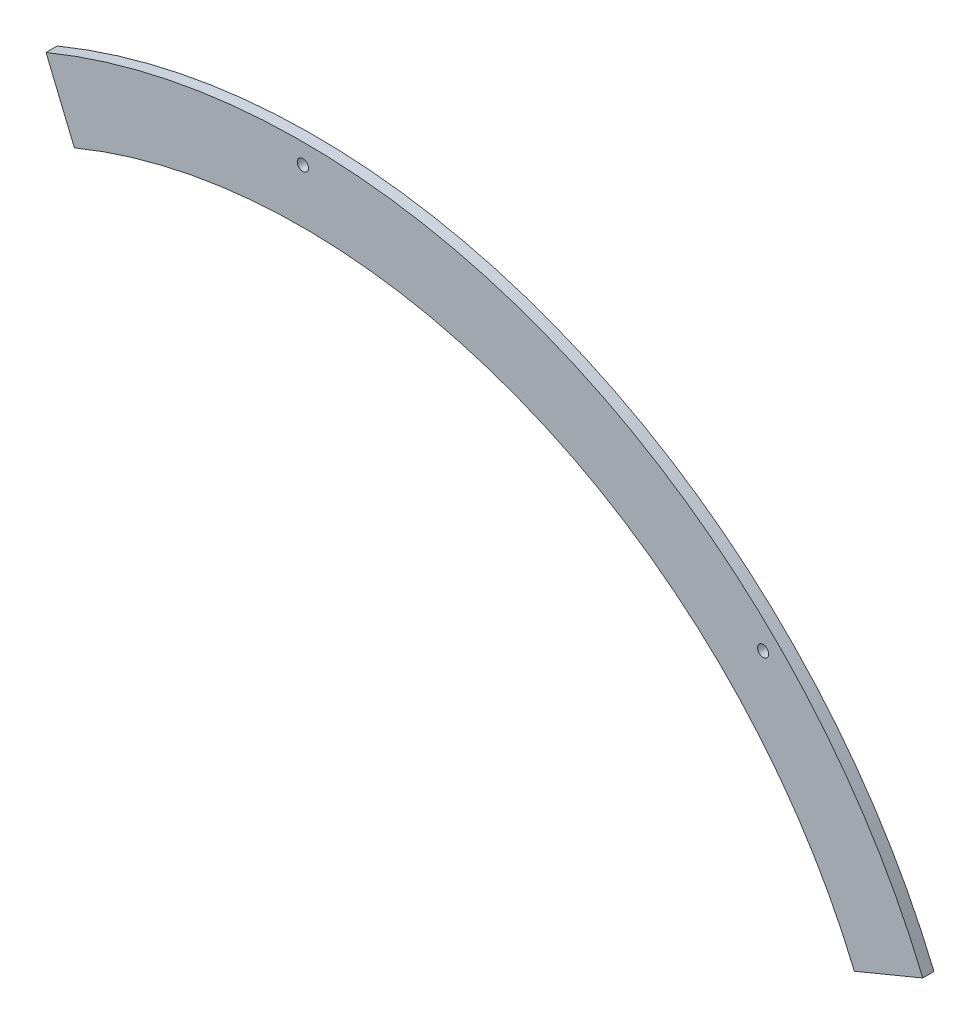
ISO-10303-21;
HEADER;
FILE_DESCRIPTION(('STEP AP214'),'2;1');
FILE_NAME('part.step','',(''),(''),'','','');
FILE_SCHEMA(('AUTOMOTIVE_DESIGN { 1 0 10303 214 1 1 1 1 }'));
ENDSEC;
DATA;
#1=APPLICATION_CONTEXT('core data for automotive mechanical design processes');
#2=APPLICATION_PROTOCOL_DEFINITION('international standard','automotive_design',2000,#1);
#3=PRODUCT_CONTEXT('',#1,'mechanical');
#4=PRODUCT('Part','Part','',(#3));
#5=PRODUCT_RELATED_PRODUCT_CATEGORY('part','',(#4));
#6=PRODUCT_DEFINITION_FORMATION('','',#4);
#7=PRODUCT_DEFINITION_CONTEXT('part definition',#1,'design');
#8=PRODUCT_DEFINITION('design','',#6,#7);
#9=PRODUCT_DEFINITION_SHAPE('','',#8);
#10=(LENGTH_UNIT() NAMED_UNIT(*) SI_UNIT(.MILLI.,.METRE.));
#11=(NAMED_UNIT(*) PLANE_ANGLE_UNIT() SI_UNIT($,.RADIAN.));
#12=(NAMED_UNIT(*) SI_UNIT($,.STERADIAN.) SOLID_ANGLE_UNIT());
#13=UNCERTAINTY_MEASURE_WITH_UNIT(LENGTH_MEASURE(1.E-05),#10,'distance_accuracy_value','');
#14=(GEOMETRIC_REPRESENTATION_CONTEXT(3) GLOBAL_UNCERTAINTY_ASSIGNED_CONTEXT((#13)) GLOBAL_UNIT_ASSIGNED_CONTEXT((#10,
#11,#12)) REPRESENTATION_CONTEXT('',''));
#15=CARTESIAN_POINT('',(0.,0.,0.));
#16=DIRECTION('',(0.,0.,1.));
#17=DIRECTION('',(1.,0.,0.));
#18=AXIS2_PLACEMENT_3D('',#15,#16,#17);
#19=CARTESIAN_POINT('',(213.438157177166,88.408979430701,-0.01));
#20=DIRECTION('',(-0.382683432365084,0.923879532511289,0.));
#21=DIRECTION('',(-0.923879532511289,-0.382683432365084,0.));
#22=AXIS2_PLACEMENT_3D('',#19,#20,#21);
#23=PLANE('',#22);
#24=DIRECTION('',(-0.923879532511289,-0.382683432365084,0.));
#25=VECTOR('',#24,1.);
#26=CARTESIAN_POINT('',(0.,0.,3.175));
#27=LINE('',#26,#25);
#28=CARTESIAN_POINT('',(175.999050943401,72.9011938655485,3.175));
#29=VERTEX_POINT('',#28);
#30=CARTESIAN_POINT('',(156.568755719249,64.8529020627919,3.175));
#31=VERTEX_POINT('',#30);
#32=EDGE_CURVE('E84',#29,#31,#27,.T.);
#33=ORIENTED_EDGE('',*,*,#32,.T.);
#34=DIRECTION('',(0.,0.,-1.));
#35=VECTOR('',#34,1.);
#36=CARTESIAN_POINT('',(156.568755719249,64.8529020627919,3.175));
#37=LINE('',#36,#35);
#38=CARTESIAN_POINT('',(156.568755719249,64.8529020627919,0.));
#39=VERTEX_POINT('',#38);
#40=EDGE_CURVE('E74',#31,#39,#37,.T.);
#41=ORIENTED_EDGE('',*,*,#40,.T.);
#42=DIRECTION('',(-0.923879532511289,-0.382683432365084,0.));
#43=VECTOR('',#42,1.);
#44=CARTESIAN_POINT('',(0.,0.,0.));
#45=LINE('',#44,#43);
#46=CARTESIAN_POINT('',(175.999050943401,72.9011938655485,0.));
#47=VERTEX_POINT('',#46);
#48=EDGE_CURVE('E108',#47,#39,#45,.T.);
#49=ORIENTED_EDGE('',*,*,#48,.F.);
#50=DIRECTION('',(0.,0.,-1.));
#51=VECTOR('',#50,1.);
#52=CARTESIAN_POINT('',(175.999050943401,72.9011938655485,3.175));
#53=LINE('',#52,#51);
#54=EDGE_CURVE('E85',#29,#47,#53,.T.);
#55=ORIENTED_EDGE('',*,*,#54,.F.);
#56=EDGE_LOOP('',(#33,#41,#49,#55));
#57=FACE_BOUND('',#56,.T.);
#58=ADVANCED_FACE('F33',(#57),#23,.F.);
#59=CARTESIAN_POINT('',(-88.4089794306965,213.438157177164,-0.01));
#60=DIRECTION('',(-0.923879532511289,-0.382683432365084,0.));
#61=DIRECTION('',(0.382683432365084,-0.923879532511289,0.));
#62=AXIS2_PLACEMENT_3D('',#59,#60,#61);
#63=PLANE('',#62);
#64=DIRECTION('',(0.382683432365084,-0.923879532511289,0.));
#65=VECTOR('',#64,1.);
#66=CARTESIAN_POINT('',(3.19252962393145E-12,1.32238906851026E-12,3.175));
#67=LINE('',#66,#65);
#68=CARTESIAN_POINT('',(-72.9011938655453,175.999050943402,3.175));
#69=VERTEX_POINT('',#68);
#70=CARTESIAN_POINT('',(-64.8529020627887,156.56875571925,3.175));
#71=VERTEX_POINT('',#70);
#72=EDGE_CURVE('E88',#69,#71,#67,.T.);
#73=ORIENTED_EDGE('',*,*,#72,.F.);
#74=DIRECTION('',(0.,0.,-1.));
#75=VECTOR('',#74,1.);
#76=CARTESIAN_POINT('',(-72.9011938655453,175.999050943402,3.175));
#77=LINE('',#76,#75);
#78=CARTESIAN_POINT('',(-72.9011938655453,175.999050943402,0.));
#79=VERTEX_POINT('',#78);
#80=EDGE_CURVE('E37',#69,#79,#77,.T.);
#81=ORIENTED_EDGE('',*,*,#80,.T.);
#82=DIRECTION('',(0.382683432365084,-0.923879532511289,0.));
#83=VECTOR('',#82,1.);
#84=CARTESIAN_POINT('',(3.19252962393145E-12,1.32238906851026E-12,0.));
#85=LINE('',#84,#83);
#86=CARTESIAN_POINT('',(-64.8529020627887,156.56875571925,0.));
#87=VERTEX_POINT('',#86);
#88=EDGE_CURVE('E89',#79,#87,#85,.T.);
#89=ORIENTED_EDGE('',*,*,#88,.T.);
#90=DIRECTION('',(0.,0.,-1.));
#91=VECTOR('',#90,1.);
#92=CARTESIAN_POINT('',(-64.8529020627888,156.568755719251,3.175));
#93=LINE('',#92,#91);
#94=EDGE_CURVE('E50',#71,#87,#93,.T.);
#95=ORIENTED_EDGE('',*,*,#94,.F.);
#96=EDGE_LOOP('',(#73,#81,#89,#95));
#97=FACE_BOUND('',#96,.T.);
#98=ADVANCED_FACE('F102',(#97),#63,.T.);
#99=CARTESIAN_POINT('',(0.,0.,3.175));
#100=DIRECTION('',(0.,0.,1.));
#101=DIRECTION('',(1.,0.,0.));
#102=AXIS2_PLACEMENT_3D('',#99,#100,#101);
#103=PLANE('',#102);
#104=CARTESIAN_POINT('',(130.662726561559,130.662726561564,3.175));
#105=DIRECTION('',(0.,0.,1.));
#106=DIRECTION('',(1.,0.,0.));
#107=AXIS2_PLACEMENT_3D('',#104,#105,#106);
#108=CIRCLE('',#107,1.58750000000112);
#109=CARTESIAN_POINT('',(132.25022656156,130.662726561564,3.175));
#110=VERTEX_POINT('',#109);
#111=EDGE_CURVE('E11',#110,#110,#108,.T.);
#112=ORIENTED_EDGE('',*,*,#111,.F.);
#113=EDGE_LOOP('',(#112));
#114=FACE_BOUND('',#113,.T.);
#115=CARTESIAN_POINT('',(0.,184.785,3.175));
#116=DIRECTION('',(0.,0.,1.));
#117=DIRECTION('',(1.,0.,0.));
#118=AXIS2_PLACEMENT_3D('',#115,#116,#117);
#119=CIRCLE('',#118,1.5875);
#120=CARTESIAN_POINT('',(1.5875,184.785,3.175));
#121=VERTEX_POINT('',#120);
#122=EDGE_CURVE('E117',#121,#121,#119,.T.);
#123=ORIENTED_EDGE('',*,*,#122,.F.);
#124=EDGE_LOOP('',(#123));
#125=FACE_BOUND('',#124,.T.);
#126=CARTESIAN_POINT('',(0.,0.,3.175));
#127=DIRECTION('',(0.,0.,1.));
#128=DIRECTION('',(1.,0.,0.));
#129=AXIS2_PLACEMENT_3D('',#126,#127,#128);
#130=CIRCLE('',#129,190.5);
#131=EDGE_CURVE('E96',#29,#69,#130,.T.);
#132=ORIENTED_EDGE('',*,*,#131,.T.);
#133=ORIENTED_EDGE('',*,*,#72,.T.);
#134=CARTESIAN_POINT('',(0.,0.,3.175));
#135=DIRECTION('',(0.,0.,1.));
#136=DIRECTION('',(1.,0.,0.));
#137=AXIS2_PLACEMENT_3D('',#134,#135,#136);
#138=CIRCLE('',#137,169.4688);
#139=EDGE_CURVE('E77',#31,#71,#138,.T.);
#140=ORIENTED_EDGE('',*,*,#139,.F.);
#141=ORIENTED_EDGE('',*,*,#32,.F.);
#142=EDGE_LOOP('',(#132,#133,#140,#141));
#143=FACE_BOUND('',#142,.T.);
#144=ADVANCED_FACE('F91',(#114,#125,#143),#103,.T.);
#145=CARTESIAN_POINT('',(0.,0.,0.));
#146=DIRECTION('',(0.,0.,1.));
#147=DIRECTION('',(1.,0.,0.));
#148=AXIS2_PLACEMENT_3D('',#145,#146,#147);
#149=PLANE('',#148);
#150=CARTESIAN_POINT('',(130.662726561559,130.662726561564,0.));
#151=DIRECTION('',(0.,0.,1.));
#152=DIRECTION('',(1.,0.,0.));
#153=AXIS2_PLACEMENT_3D('',#150,#151,#152);
#154=CIRCLE('',#153,1.58750000000112);
#155=CARTESIAN_POINT('',(132.25022656156,130.662726561564,0.));
#156=VERTEX_POINT('',#155);
#157=EDGE_CURVE('E42',#156,#156,#154,.T.);
#158=ORIENTED_EDGE('',*,*,#157,.T.);
#159=EDGE_LOOP('',(#158));
#160=FACE_BOUND('',#159,.T.);
#161=CARTESIAN_POINT('',(0.,184.785,0.));
#162=DIRECTION('',(0.,0.,1.));
#163=DIRECTION('',(1.,0.,0.));
#164=AXIS2_PLACEMENT_3D('',#161,#162,#163);
#165=CIRCLE('',#164,1.5875);
#166=CARTESIAN_POINT('',(1.5875,184.785,0.));
#167=VERTEX_POINT('',#166);
#168=EDGE_CURVE('E94',#167,#167,#165,.T.);
#169=ORIENTED_EDGE('',*,*,#168,.T.);
#170=EDGE_LOOP('',(#169));
#171=FACE_BOUND('',#170,.T.);
#172=ORIENTED_EDGE('',*,*,#88,.F.);
#173=CARTESIAN_POINT('',(0.,0.,0.));
#174=DIRECTION('',(0.,0.,1.));
#175=DIRECTION('',(1.,0.,0.));
#176=AXIS2_PLACEMENT_3D('',#173,#174,#175);
#177=CIRCLE('',#176,190.5);
#178=EDGE_CURVE('E92',#47,#79,#177,.T.);
#179=ORIENTED_EDGE('',*,*,#178,.F.);
#180=ORIENTED_EDGE('',*,*,#48,.T.);
#181=CARTESIAN_POINT('',(0.,0.,0.));
#182=DIRECTION('',(0.,0.,1.));
#183=DIRECTION('',(1.,0.,0.));
#184=AXIS2_PLACEMENT_3D('',#181,#182,#183);
#185=CIRCLE('',#184,169.4688);
#186=EDGE_CURVE('E79',#39,#87,#185,.T.);
#187=ORIENTED_EDGE('',*,*,#186,.T.);
#188=EDGE_LOOP('',(#172,#179,#180,#187));
#189=FACE_BOUND('',#188,.T.);
#190=ADVANCED_FACE('F107',(#160,#171,#189),#149,.F.);
#191=CARTESIAN_POINT('',(0.,0.,3.175));
#192=DIRECTION('',(0.,0.,-1.));
#193=DIRECTION('',(-1.,0.,0.));
#194=AXIS2_PLACEMENT_3D('',#191,#192,#193);
#195=CYLINDRICAL_SURFACE('',#194,190.5);
#196=ORIENTED_EDGE('',*,*,#80,.F.);
#197=ORIENTED_EDGE('',*,*,#131,.F.);
#198=ORIENTED_EDGE('',*,*,#54,.T.);
#199=ORIENTED_EDGE('',*,*,#178,.T.);
#200=EDGE_LOOP('',(#196,#197,#198,#199));
#201=FACE_BOUND('',#200,.T.);
#202=ADVANCED_FACE('F104',(#201),#195,.T.);
#203=CARTESIAN_POINT('',(0.,0.,3.175));
#204=DIRECTION('',(0.,0.,-1.));
#205=DIRECTION('',(-1.,0.,0.));
#206=AXIS2_PLACEMENT_3D('',#203,#204,#205);
#207=CYLINDRICAL_SURFACE('',#206,169.4688);
#208=ORIENTED_EDGE('',*,*,#139,.T.);
#209=ORIENTED_EDGE('',*,*,#94,.T.);
#210=ORIENTED_EDGE('',*,*,#186,.F.);
#211=ORIENTED_EDGE('',*,*,#40,.F.);
#212=EDGE_LOOP('',(#208,#209,#210,#211));
#213=FACE_BOUND('',#212,.T.);
#214=ADVANCED_FACE('F35',(#213),#207,.F.);
#215=CARTESIAN_POINT('',(130.662726561559,130.662726561564,0.));
#216=DIRECTION('',(0.,0.,1.));
#217=DIRECTION('',(1.,0.,0.));
#218=AXIS2_PLACEMENT_3D('',#215,#216,#217);
#219=CYLINDRICAL_SURFACE('',#218,1.58750000000112);
#220=ORIENTED_EDGE('',*,*,#157,.F.);
#221=EDGE_LOOP('',(#220));
#222=FACE_BOUND('',#221,.T.);
#223=ORIENTED_EDGE('',*,*,#111,.T.);
#224=EDGE_LOOP('',(#223));
#225=FACE_BOUND('',#224,.T.);
#226=ADVANCED_FACE('F126',(#222,#225),#219,.F.);
#227=CARTESIAN_POINT('',(0.,184.785,0.));
#228=DIRECTION('',(0.,0.,1.));
#229=DIRECTION('',(1.,0.,0.));
#230=AXIS2_PLACEMENT_3D('',#227,#228,#229);
#231=CYLINDRICAL_SURFACE('',#230,1.5875);
#232=ORIENTED_EDGE('',*,*,#168,.F.);
#233=EDGE_LOOP('',(#232));
#234=FACE_BOUND('',#233,.T.);
#235=ORIENTED_EDGE('',*,*,#122,.T.);
#236=EDGE_LOOP('',(#235));
#237=FACE_BOUND('',#236,.T.);
#238=ADVANCED_FACE('F123',(#234,#237),#231,.F.);
#239=CLOSED_SHELL('',(#58,#98,#144,#190,#202,#214,#226,#238));
#240=MANIFOLD_SOLID_BREP('B2',#239);
#241=ADVANCED_BREP_SHAPE_REPRESENTATION('',(#18,#240),#14);
#242=SHAPE_DEFINITION_REPRESENTATION(#9,#241);
ENDSEC;
END-ISO-10303-21;
